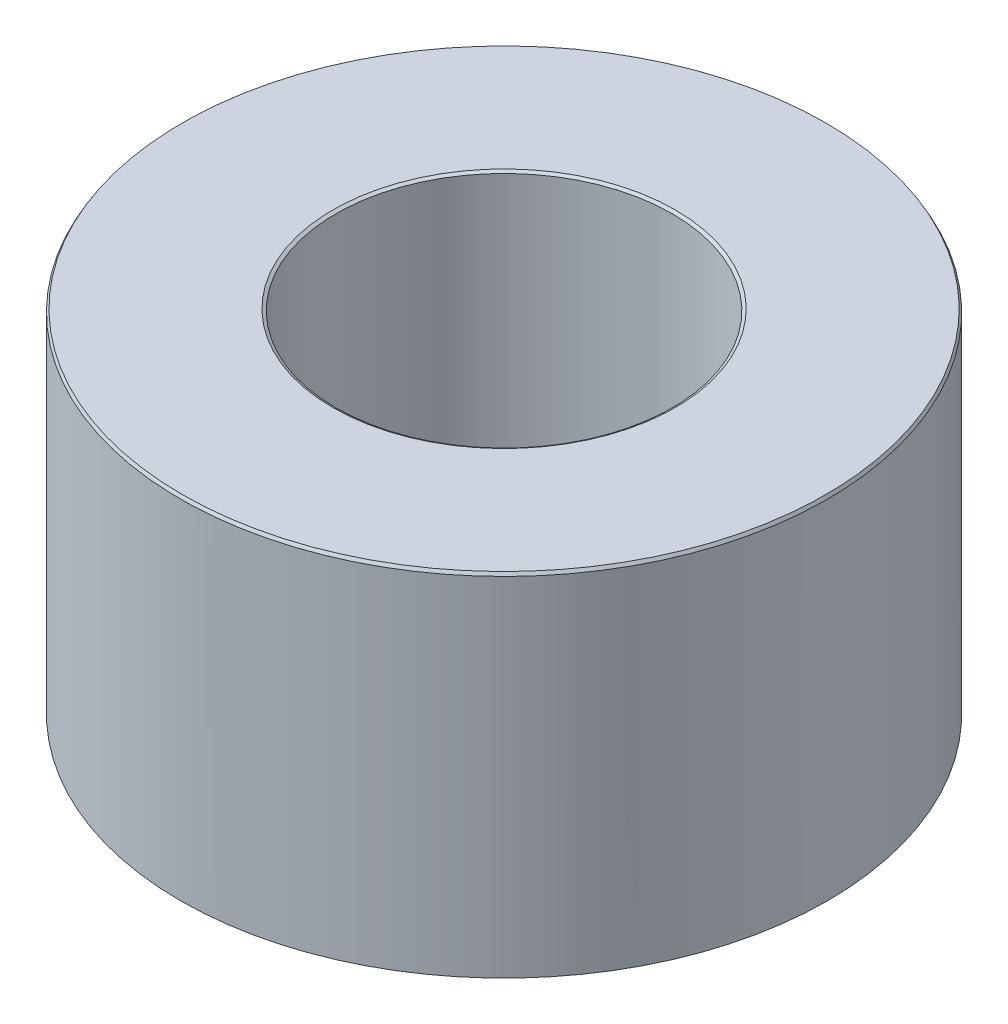
ISO-10303-21;
HEADER;
FILE_DESCRIPTION(('STEP AP214'),'2;1');
FILE_NAME('part.step','',(''),(''),'','','');
FILE_SCHEMA(('AUTOMOTIVE_DESIGN { 1 0 10303 214 1 1 1 1 }'));
ENDSEC;
DATA;
#1=APPLICATION_CONTEXT('core data for automotive mechanical design processes');
#2=APPLICATION_PROTOCOL_DEFINITION('international standard','automotive_design',2000,#1);
#3=PRODUCT_CONTEXT('',#1,'mechanical');
#4=PRODUCT('Part','Part','',(#3));
#5=PRODUCT_RELATED_PRODUCT_CATEGORY('part','',(#4));
#6=PRODUCT_DEFINITION_FORMATION('','',#4);
#7=PRODUCT_DEFINITION_CONTEXT('part definition',#1,'design');
#8=PRODUCT_DEFINITION('design','',#6,#7);
#9=PRODUCT_DEFINITION_SHAPE('','',#8);
#10=(LENGTH_UNIT() NAMED_UNIT(*) SI_UNIT(.MILLI.,.METRE.));
#11=(NAMED_UNIT(*) PLANE_ANGLE_UNIT() SI_UNIT($,.RADIAN.));
#12=(NAMED_UNIT(*) SI_UNIT($,.STERADIAN.) SOLID_ANGLE_UNIT());
#13=UNCERTAINTY_MEASURE_WITH_UNIT(LENGTH_MEASURE(1.E-05),#10,'distance_accuracy_value','');
#14=(GEOMETRIC_REPRESENTATION_CONTEXT(3) GLOBAL_UNCERTAINTY_ASSIGNED_CONTEXT((#13)) GLOBAL_UNIT_ASSIGNED_CONTEXT((#10,
#11,#12)) REPRESENTATION_CONTEXT('',''));
#15=CARTESIAN_POINT('',(0.,0.,0.));
#16=DIRECTION('',(0.,0.,1.));
#17=DIRECTION('',(1.,0.,0.));
#18=AXIS2_PLACEMENT_3D('',#15,#16,#17);
#19=CARTESIAN_POINT('',(0.,24.5218995649881,0.));
#20=DIRECTION('',(0.,-1.,0.));
#21=DIRECTION('',(0.,0.,-1.));
#22=AXIS2_PLACEMENT_3D('',#19,#20,#21);
#23=CYLINDRICAL_SURFACE('',#22,22.5);
#24=CARTESIAN_POINT('',(0.,0.122359580149285,0.));
#25=DIRECTION('',(0.,1.,0.));
#26=DIRECTION('',(0.,0.,1.));
#27=AXIS2_PLACEMENT_3D('',#24,#25,#26);
#28=CIRCLE('',#27,22.5);
#29=CARTESIAN_POINT('',(0.,0.122359580149282,-22.5));
#30=VERTEX_POINT('',#29);
#31=EDGE_CURVE('E10',#30,#30,#28,.T.);
#32=CARTESIAN_POINT('',(0.,24.3099665553768,0.));
#33=DIRECTION('',(0.,1.,0.));
#34=DIRECTION('',(0.,0.,1.));
#35=AXIS2_PLACEMENT_3D('',#32,#33,#34);
#36=CIRCLE('',#35,22.5);
#37=CARTESIAN_POINT('',(0.,24.3099665553768,-22.5));
#38=VERTEX_POINT('',#37);
#39=EDGE_CURVE('E50',#38,#38,#36,.F.);
#40=CARTESIAN_POINT('',(0.,0.122359580149282,-22.5));
#41=CARTESIAN_POINT('',(0.,0.374313819474569,-22.5));
#42=CARTESIAN_POINT('',(0.,0.626268058799857,-22.5));
#43=CARTESIAN_POINT('',(0.,1.13017653745043,-22.5));
#44=CARTESIAN_POINT('',(0.,1.38213077677572,-22.5));
#45=CARTESIAN_POINT('',(0.,1.88603925542629,-22.5));
#46=CARTESIAN_POINT('',(0.,2.13799349475158,-22.5));
#47=CARTESIAN_POINT('',(0.,2.64190197340215,-22.5));
#48=CARTESIAN_POINT('',(0.,2.89385621272744,-22.5));
#49=CARTESIAN_POINT('',(0.,3.39776469137801,-22.5));
#50=CARTESIAN_POINT('',(0.,3.6497189307033,-22.5));
#51=CARTESIAN_POINT('',(0.,4.15362740935387,-22.5));
#52=CARTESIAN_POINT('',(0.,4.40558164867916,-22.5));
#53=CARTESIAN_POINT('',(0.,4.90949012732974,-22.5));
#54=CARTESIAN_POINT('',(0.,5.16144436665502,-22.5));
#55=CARTESIAN_POINT('',(0.,5.66535284530559,-22.5));
#56=CARTESIAN_POINT('',(0.,5.91730708463088,-22.5));
#57=CARTESIAN_POINT('',(0.,6.42121556328146,-22.5));
#58=CARTESIAN_POINT('',(0.,6.67316980260674,-22.5));
#59=CARTESIAN_POINT('',(0.,7.17707828125732,-22.5));
#60=CARTESIAN_POINT('',(0.,7.4290325205826,-22.5));
#61=CARTESIAN_POINT('',(0.,7.93294099923318,-22.5));
#62=CARTESIAN_POINT('',(0.,8.18489523855847,-22.5));
#63=CARTESIAN_POINT('',(0.,8.68880371720904,-22.5));
#64=CARTESIAN_POINT('',(0.,8.94075795653433,-22.5));
#65=CARTESIAN_POINT('',(0.,9.4446664351849,-22.5));
#66=CARTESIAN_POINT('',(0.,9.69662067451018,-22.5));
#67=CARTESIAN_POINT('',(0.,10.2005291531608,-22.5));
#68=CARTESIAN_POINT('',(0.,10.452483392486,-22.5));
#69=CARTESIAN_POINT('',(0.,10.9563918711366,-22.5));
#70=CARTESIAN_POINT('',(0.,11.2083461104619,-22.5));
#71=CARTESIAN_POINT('',(0.,11.7122545891125,-22.5));
#72=CARTESIAN_POINT('',(0.,11.9642088284378,-22.5));
#73=CARTESIAN_POINT('',(0.,12.4681173070883,-22.5));
#74=CARTESIAN_POINT('',(0.,12.7200715464136,-22.5));
#75=CARTESIAN_POINT('',(0.,13.2239800250642,-22.5));
#76=CARTESIAN_POINT('',(0.,13.4759342643895,-22.5));
#77=CARTESIAN_POINT('',(0.,13.9798427430401,-22.5));
#78=CARTESIAN_POINT('',(0.,14.2317969823654,-22.5));
#79=CARTESIAN_POINT('',(0.,14.7357054610159,-22.5));
#80=CARTESIAN_POINT('',(0.,14.9876597003412,-22.5));
#81=CARTESIAN_POINT('',(0.,15.4915681789918,-22.5));
#82=CARTESIAN_POINT('',(0.,15.7435224183171,-22.5));
#83=CARTESIAN_POINT('',(0.,16.2474308969676,-22.5));
#84=CARTESIAN_POINT('',(0.,16.4993851362929,-22.5));
#85=CARTESIAN_POINT('',(0.,17.0032936149435,-22.5));
#86=CARTESIAN_POINT('',(0.,17.2552478542688,-22.5));
#87=CARTESIAN_POINT('',(0.,17.7591563329194,-22.5));
#88=CARTESIAN_POINT('',(0.,18.0111105722447,-22.5));
#89=CARTESIAN_POINT('',(0.,18.5150190508952,-22.5));
#90=CARTESIAN_POINT('',(0.,18.7669732902205,-22.5));
#91=CARTESIAN_POINT('',(0.,19.2708817688711,-22.5));
#92=CARTESIAN_POINT('',(0.,19.5228360081964,-22.5));
#93=CARTESIAN_POINT('',(0.,20.0267444868469,-22.5));
#94=CARTESIAN_POINT('',(0.,20.2786987261722,-22.5));
#95=CARTESIAN_POINT('',(0.,20.7826072048228,-22.5));
#96=CARTESIAN_POINT('',(0.,21.0345614441481,-22.5));
#97=CARTESIAN_POINT('',(0.,21.5384699227987,-22.5));
#98=CARTESIAN_POINT('',(0.,21.790424162124,-22.5));
#99=CARTESIAN_POINT('',(0.,22.2943326407745,-22.5));
#100=CARTESIAN_POINT('',(0.,22.5462868800998,-22.5));
#101=CARTESIAN_POINT('',(0.,23.0501953587504,-22.5));
#102=CARTESIAN_POINT('',(0.,23.3021495980757,-22.5));
#103=CARTESIAN_POINT('',(0.,23.8060580767263,-22.5));
#104=CARTESIAN_POINT('',(0.,24.0580123160515,-22.5));
#105=CARTESIAN_POINT('',(0.,24.3099665553768,-22.5));
#106=B_SPLINE_CURVE_WITH_KNOTS('',3,(#40,#41,#42,#43,#44,#45,#46,#47,#48,#49,#50,#51,#52,#53,
#54,#55,#56,#57,#58,#59,#60,#61,#62,#63,#64,#65,#66,#67,#68,#69,#70,#71,#72,#73,#74,#75,#76,#77,
#78,#79,#80,#81,#82,#83,#84,#85,#86,#87,#88,#89,#90,#91,#92,#93,#94,#95,#96,#97,#98,#99,#100,
#101,#102,#103,#104,#105),.UNSPECIFIED.,.F.,.F.,(4,2,2,2,2,2,2,2,2,2,2,2,2,2,2,2,2,2,2,2,2,2,2,
2,2,2,2,2,2,2,2,2,4),(0.,0.755862717975862,1.51172543595172,2.26758815392758,3.02345087190344,
3.7793135898793,4.53517630785517,5.29103902583103,6.04690174380689,6.80276446178275,
7.55862717975861,8.31448989773447,9.07035261571033,9.82621533368619,10.5820780516621,
11.3379407696379,12.0938034876138,12.8496662055896,13.6055289235655,14.3613916415414,
15.1172543595172,15.8731170774931,16.6289797954689,17.3848425134448,18.1407052314207,
18.8965679493965,19.6524306673724,20.4082933853482,21.1641561033241,21.9200188213,
22.6758815392758,23.4317442572517,24.1876069752275),.UNSPECIFIED.);
#107=EDGE_CURVE('BSEAM39',#30,#38,#106,.T.);
#108=ORIENTED_EDGE('',*,*,#31,.T.);
#109=ORIENTED_EDGE('',*,*,#39,.T.);
#110=ORIENTED_EDGE('',*,*,#107,.T.);
#111=ORIENTED_EDGE('',*,*,#107,.F.);
#112=EDGE_LOOP('',(#108,#110,#109,#111));
#113=FACE_BOUND('',#112,.T.);
#114=ADVANCED_FACE('F39',(#113),#23,.T.);
#115=CARTESIAN_POINT('',(0.,24.5218995649881,0.));
#116=DIRECTION('',(0.,1.,0.));
#117=DIRECTION('',(0.,0.,1.));
#118=AXIS2_PLACEMENT_3D('',#115,#116,#117);
#119=PLANE('',#118);
#120=CARTESIAN_POINT('',(0.,24.5218995649881,0.));
#121=DIRECTION('',(0.,1.,0.));
#122=DIRECTION('',(0.,0.,1.));
#123=AXIS2_PLACEMENT_3D('',#120,#121,#122);
#124=CIRCLE('',#123,11.9055841258834);
#125=CARTESIAN_POINT('',(0.,24.5218995649881,11.9055841258834));
#126=VERTEX_POINT('',#125);
#127=EDGE_CURVE('E58',#126,#126,#124,.F.);
#128=ORIENTED_EDGE('',*,*,#127,.T.);
#129=EDGE_LOOP('',(#128));
#130=FACE_BOUND('',#129,.T.);
#131=CARTESIAN_POINT('',(0.,24.5218995649881,0.));
#132=DIRECTION('',(0.,1.,0.));
#133=DIRECTION('',(0.,0.,1.));
#134=AXIS2_PLACEMENT_3D('',#131,#132,#133);
#135=CIRCLE('',#134,22.3776404198508);
#136=CARTESIAN_POINT('',(0.,24.5218995649881,22.3776404198508));
#137=VERTEX_POINT('',#136);
#138=EDGE_CURVE('E61',#137,#137,#135,.T.);
#139=ORIENTED_EDGE('',*,*,#138,.T.);
#140=EDGE_LOOP('',(#139));
#141=FACE_BOUND('',#140,.T.);
#142=ADVANCED_FACE('F88',(#130,#141),#119,.T.);
#143=CARTESIAN_POINT('',(0.,0.,0.));
#144=DIRECTION('',(0.,1.,0.));
#145=DIRECTION('',(0.,0.,1.));
#146=AXIS2_PLACEMENT_3D('',#143,#144,#145);
#147=PLANE('',#146);
#148=CARTESIAN_POINT('',(0.,0.,0.));
#149=DIRECTION('',(0.,1.,0.));
#150=DIRECTION('',(0.,0.,1.));
#151=AXIS2_PLACEMENT_3D('',#148,#149,#150);
#152=CIRCLE('',#151,11.8160106964213);
#153=CARTESIAN_POINT('',(0.,0.,-11.8160106964213));
#154=VERTEX_POINT('',#153);
#155=EDGE_CURVE('E51',#154,#154,#152,.T.);
#156=ORIENTED_EDGE('',*,*,#155,.T.);
#157=EDGE_LOOP('',(#156));
#158=FACE_BOUND('',#157,.T.);
#159=CARTESIAN_POINT('',(0.,0.,0.));
#160=DIRECTION('',(0.,1.,0.));
#161=DIRECTION('',(0.,0.,1.));
#162=AXIS2_PLACEMENT_3D('',#159,#160,#161);
#163=CIRCLE('',#162,22.2880669903886);
#164=CARTESIAN_POINT('',(0.,0.,22.2880669903886));
#165=VERTEX_POINT('',#164);
#166=EDGE_CURVE('E54',#165,#165,#163,.F.);
#167=ORIENTED_EDGE('',*,*,#166,.T.);
#168=EDGE_LOOP('',(#167));
#169=FACE_BOUND('',#168,.T.);
#170=ADVANCED_FACE('F83',(#158,#169),#147,.F.);
#171=CARTESIAN_POINT('',(0.,24.5218995649881,0.));
#172=DIRECTION('',(0.,-1.,0.));
#173=DIRECTION('',(0.,0.,-1.));
#174=AXIS2_PLACEMENT_3D('',#171,#172,#173);
#175=CYLINDRICAL_SURFACE('',#174,11.693651116272);
#176=CARTESIAN_POINT('',(0.,24.3995399848388,0.));
#177=DIRECTION('',(0.,1.,0.));
#178=DIRECTION('',(0.,0.,1.));
#179=AXIS2_PLACEMENT_3D('',#176,#177,#178);
#180=CIRCLE('',#179,11.693651116272);
#181=CARTESIAN_POINT('',(0.,24.3995399848388,-11.693651116272));
#182=VERTEX_POINT('',#181);
#183=EDGE_CURVE('E67',#182,#182,#180,.T.);
#184=CARTESIAN_POINT('',(0.,0.211933009611285,0.));
#185=DIRECTION('',(0.,1.,0.));
#186=DIRECTION('',(0.,0.,1.));
#187=AXIS2_PLACEMENT_3D('',#184,#185,#186);
#188=CIRCLE('',#187,11.693651116272);
#189=CARTESIAN_POINT('',(0.,0.211933009611285,-11.693651116272));
#190=VERTEX_POINT('',#189);
#191=EDGE_CURVE('E69',#190,#190,#188,.F.);
#192=CARTESIAN_POINT('',(0.,24.3995399848388,-11.693651116272));
#193=CARTESIAN_POINT('',(0.,24.1475857455136,-11.693651116272));
#194=CARTESIAN_POINT('',(0.,23.8956315061883,-11.693651116272));
#195=CARTESIAN_POINT('',(0.,23.3917230275377,-11.693651116272));
#196=CARTESIAN_POINT('',(0.,23.1397687882124,-11.693651116272));
#197=CARTESIAN_POINT('',(0.,22.6358603095618,-11.693651116272));
#198=CARTESIAN_POINT('',(0.,22.3839060702365,-11.693651116272));
#199=CARTESIAN_POINT('',(0.,21.879997591586,-11.693651116272));
#200=CARTESIAN_POINT('',(0.,21.6280433522607,-11.693651116272));
#201=CARTESIAN_POINT('',(0.,21.1241348736101,-11.693651116272));
#202=CARTESIAN_POINT('',(0.,20.8721806342848,-11.693651116272));
#203=CARTESIAN_POINT('',(0.,20.3682721556342,-11.693651116272));
#204=CARTESIAN_POINT('',(0.,20.116317916309,-11.693651116272));
#205=CARTESIAN_POINT('',(0.,19.6124094376584,-11.693651116272));
#206=CARTESIAN_POINT('',(0.,19.3604551983331,-11.693651116272));
#207=CARTESIAN_POINT('',(0.,18.8565467196825,-11.693651116272));
#208=CARTESIAN_POINT('',(0.,18.6045924803572,-11.693651116272));
#209=CARTESIAN_POINT('',(0.,18.1006840017067,-11.693651116272));
#210=CARTESIAN_POINT('',(0.,17.8487297623814,-11.693651116272));
#211=CARTESIAN_POINT('',(0.,17.3448212837308,-11.693651116272));
#212=CARTESIAN_POINT('',(0.,17.0928670444055,-11.693651116272));
#213=CARTESIAN_POINT('',(0.,16.5889585657549,-11.693651116272));
#214=CARTESIAN_POINT('',(0.,16.3370043264297,-11.693651116272));
#215=CARTESIAN_POINT('',(0.,15.8330958477791,-11.693651116272));
#216=CARTESIAN_POINT('',(0.,15.5811416084538,-11.693651116272));
#217=CARTESIAN_POINT('',(0.,15.0772331298032,-11.693651116272));
#218=CARTESIAN_POINT('',(0.,14.8252788904779,-11.693651116272));
#219=CARTESIAN_POINT('',(0.,14.3213704118274,-11.693651116272));
#220=CARTESIAN_POINT('',(0.,14.0694161725021,-11.693651116272));
#221=CARTESIAN_POINT('',(0.,13.5655076938515,-11.693651116272));
#222=CARTESIAN_POINT('',(0.,13.3135534545262,-11.693651116272));
#223=CARTESIAN_POINT('',(0.,12.8096449758756,-11.693651116272));
#224=CARTESIAN_POINT('',(0.,12.5576907365504,-11.693651116272));
#225=CARTESIAN_POINT('',(0.,12.0537822578998,-11.693651116272));
#226=CARTESIAN_POINT('',(0.,11.8018280185745,-11.693651116272));
#227=CARTESIAN_POINT('',(0.,11.2979195399239,-11.693651116272));
#228=CARTESIAN_POINT('',(0.,11.0459653005986,-11.693651116272));
#229=CARTESIAN_POINT('',(0.,10.5420568219481,-11.693651116272));
#230=CARTESIAN_POINT('',(0.,10.2901025826228,-11.693651116272));
#231=CARTESIAN_POINT('',(0.,9.78619410397219,-11.693651116272));
#232=CARTESIAN_POINT('',(0.,9.53423986464691,-11.693651116272));
#233=CARTESIAN_POINT('',(0.,9.03033138599633,-11.693651116272));
#234=CARTESIAN_POINT('',(0.,8.77837714667105,-11.693651116272));
#235=CARTESIAN_POINT('',(0.,8.27446866802048,-11.693651116272));
#236=CARTESIAN_POINT('',(0.,8.02251442869519,-11.693651116272));
#237=CARTESIAN_POINT('',(0.,7.51860595004461,-11.693651116272));
#238=CARTESIAN_POINT('',(0.,7.26665171071933,-11.693651116272));
#239=CARTESIAN_POINT('',(0.,6.76274323206875,-11.693651116272));
#240=CARTESIAN_POINT('',(0.,6.51078899274346,-11.693651116272));
#241=CARTESIAN_POINT('',(0.,6.00688051409289,-11.693651116272));
#242=CARTESIAN_POINT('',(0.,5.7549262747676,-11.693651116272));
#243=CARTESIAN_POINT('',(0.,5.25101779611703,-11.693651116272));
#244=CARTESIAN_POINT('',(0.,4.99906355679174,-11.693651116272));
#245=CARTESIAN_POINT('',(0.,4.49515507814116,-11.693651116272));
#246=CARTESIAN_POINT('',(0.,4.24320083881588,-11.693651116272));
#247=CARTESIAN_POINT('',(0.,3.7392923601653,-11.693651116272));
#248=CARTESIAN_POINT('',(0.,3.48733812084002,-11.693651116272));
#249=CARTESIAN_POINT('',(0.,2.98342964218945,-11.693651116272));
#250=CARTESIAN_POINT('',(0.,2.73147540286416,-11.693651116272));
#251=CARTESIAN_POINT('',(0.,2.22756692421358,-11.693651116272));
#252=CARTESIAN_POINT('',(0.,1.9756126848883,-11.693651116272));
#253=CARTESIAN_POINT('',(0.,1.47170420623772,-11.693651116272));
#254=CARTESIAN_POINT('',(0.,1.21974996691243,-11.693651116272));
#255=CARTESIAN_POINT('',(0.,0.71584148826186,-11.693651116272));
#256=CARTESIAN_POINT('',(0.,0.463887248936572,-11.693651116272));
#257=CARTESIAN_POINT('',(0.,0.211933009611285,-11.693651116272));
#258=B_SPLINE_CURVE_WITH_KNOTS('',3,(#192,#193,#194,#195,#196,#197,#198,#199,#200,#201,#202,
#203,#204,#205,#206,#207,#208,#209,#210,#211,#212,#213,#214,#215,#216,#217,#218,#219,#220,#221,
#222,#223,#224,#225,#226,#227,#228,#229,#230,#231,#232,#233,#234,#235,#236,#237,#238,#239,#240,
#241,#242,#243,#244,#245,#246,#247,#248,#249,#250,#251,#252,#253,#254,#255,#256,#257),
.UNSPECIFIED.,.F.,.F.,(4,2,2,2,2,2,2,2,2,2,2,2,2,2,2,2,2,2,2,2,2,2,2,2,2,2,2,2,2,2,2,2,4),(0.,
0.755862717975862,1.51172543595172,2.26758815392758,3.02345087190345,3.77931358987931,
4.53517630785517,5.29103902583103,6.04690174380689,6.80276446178275,7.55862717975861,
8.31448989773448,9.07035261571033,9.8262153336862,10.5820780516621,11.3379407696379,
12.0938034876138,12.8496662055896,13.6055289235655,14.3613916415414,15.1172543595172,
15.8731170774931,16.6289797954689,17.3848425134448,18.1407052314207,18.8965679493965,
19.6524306673724,20.4082933853483,21.1641561033241,21.9200188213,22.6758815392758,
23.4317442572517,24.1876069752276),.UNSPECIFIED.);
#259=EDGE_CURVE('BSEAM71',#182,#190,#258,.T.);
#260=ORIENTED_EDGE('',*,*,#183,.T.);
#261=ORIENTED_EDGE('',*,*,#191,.T.);
#262=ORIENTED_EDGE('',*,*,#259,.T.);
#263=ORIENTED_EDGE('',*,*,#259,.F.);
#264=EDGE_LOOP('',(#260,#262,#261,#263));
#265=FACE_BOUND('',#264,.T.);
#266=ADVANCED_FACE('F71',(#265),#175,.F.);
#267=CARTESIAN_POINT('',(0.,24.3995399848388,0.));
#268=DIRECTION('',(0.,1.,0.));
#269=DIRECTION('',(0.,0.,1.));
#270=AXIS2_PLACEMENT_3D('',#267,#268,#269);
#271=CONICAL_SURFACE('',#270,11.693651116272,1.04719755119661);
#272=ORIENTED_EDGE('',*,*,#127,.F.);
#273=EDGE_LOOP('',(#272));
#274=FACE_BOUND('',#273,.T.);
#275=ORIENTED_EDGE('',*,*,#183,.F.);
#276=EDGE_LOOP('',(#275));
#277=FACE_BOUND('',#276,.T.);
#278=ADVANCED_FACE('F77',(#274,#277),#271,.F.);
#279=CARTESIAN_POINT('',(0.,0.,0.));
#280=DIRECTION('',(0.,-1.,0.));
#281=DIRECTION('',(0.,0.,-1.));
#282=AXIS2_PLACEMENT_3D('',#279,#280,#281);
#283=CONICAL_SURFACE('',#282,11.8160106964213,0.523598775598301);
#284=CARTESIAN_POINT('',(0.,0.211933009611285,-11.693651116272));
#285=CARTESIAN_POINT('',(0.,0.2097253740945,-11.6949256952319));
#286=CARTESIAN_POINT('',(0.,0.207517738577716,-11.6962002741918));
#287=CARTESIAN_POINT('',(0.,0.203102467544148,-11.6987494321116));
#288=CARTESIAN_POINT('',(0.,0.200894832027364,-11.7000240110715));
#289=CARTESIAN_POINT('',(0.,0.196479560993796,-11.7025731689912));
#290=CARTESIAN_POINT('',(0.,0.194271925477011,-11.7038477479511));
#291=CARTESIAN_POINT('',(0.,0.189856654443443,-11.7063969058709));
#292=CARTESIAN_POINT('',(0.,0.187649018926658,-11.7076714848308));
#293=CARTESIAN_POINT('',(0.,0.18323374789309,-11.7102206427506));
#294=CARTESIAN_POINT('',(0.,0.181026112376306,-11.7114952217104));
#295=CARTESIAN_POINT('',(0.,0.176610841342738,-11.7140443796302));
#296=CARTESIAN_POINT('',(0.,0.174403205825953,-11.7153189585901));
#297=CARTESIAN_POINT('',(0.,0.169987934792385,-11.7178681165099));
#298=CARTESIAN_POINT('',(0.,0.167780299275601,-11.7191426954698));
#299=CARTESIAN_POINT('',(0.,0.163365028242032,-11.7216918533895));
#300=CARTESIAN_POINT('',(0.,0.161157392725248,-11.7229664323494));
#301=CARTESIAN_POINT('',(0.,0.156742121691679,-11.7255155902692));
#302=CARTESIAN_POINT('',(0.,0.154534486174895,-11.7267901692291));
#303=CARTESIAN_POINT('',(0.,0.150119215141327,-11.7293393271489));
#304=CARTESIAN_POINT('',(0.,0.147911579624543,-11.7306139061088));
#305=CARTESIAN_POINT('',(0.,0.143496308590974,-11.7331630640285));
#306=CARTESIAN_POINT('',(0.,0.14128867307419,-11.7344376429884));
#307=CARTESIAN_POINT('',(0.,0.136873402040621,-11.7369868009082));
#308=CARTESIAN_POINT('',(0.,0.134665766523837,-11.7382613798681));
#309=CARTESIAN_POINT('',(0.,0.130250495490269,-11.7408105377879));
#310=CARTESIAN_POINT('',(0.,0.128042859973485,-11.7420851167478));
#311=CARTESIAN_POINT('',(0.,0.123627588939916,-11.7446342746675));
#312=CARTESIAN_POINT('',(0.,0.121419953423132,-11.7459088536274));
#313=CARTESIAN_POINT('',(0.,0.117004682389563,-11.7484580115472));
#314=CARTESIAN_POINT('',(0.,0.114797046872779,-11.7497325905071));
#315=CARTESIAN_POINT('',(0.,0.110381775839211,-11.7522817484269));
#316=CARTESIAN_POINT('',(0.,0.108174140322427,-11.7535563273867));
#317=CARTESIAN_POINT('',(0.,0.103758869288858,-11.7561054853065));
#318=CARTESIAN_POINT('',(0.,0.101551233772074,-11.7573800642664));
#319=CARTESIAN_POINT('',(0.,0.0971359627385055,-11.7599292221862));
#320=CARTESIAN_POINT('',(0.,0.0949283272217215,-11.7612038011461));
#321=CARTESIAN_POINT('',(0.,0.0905130561881531,-11.7637529590659));
#322=CARTESIAN_POINT('',(0.,0.0883054206713688,-11.7650275380257));
#323=CARTESIAN_POINT('',(0.,0.0838901496378002,-11.7675766959455));
#324=CARTESIAN_POINT('',(0.,0.0816825141210159,-11.7688512749054));
#325=CARTESIAN_POINT('',(0.,0.0772672430874475,-11.7714004328252));
#326=CARTESIAN_POINT('',(0.,0.0750596075706635,-11.7726750117851));
#327=CARTESIAN_POINT('',(0.,0.0706443365370951,-11.7752241697048));
#328=CARTESIAN_POINT('',(0.,0.0684367010203106,-11.7764987486647));
#329=CARTESIAN_POINT('',(0.,0.0640214299867422,-11.7790479065845));
#330=CARTESIAN_POINT('',(0.,0.0618137944699582,-11.7803224855444));
#331=CARTESIAN_POINT('',(0.,0.0573985234363898,-11.7828716434642));
#332=CARTESIAN_POINT('',(0.,0.0551908879196055,-11.7841462224241));
#333=CARTESIAN_POINT('',(0.,0.0507756168860369,-11.7866953803438));
#334=CARTESIAN_POINT('',(0.,0.0485679813692526,-11.7879699593037));
#335=CARTESIAN_POINT('',(0.,0.0441527103356843,-11.7905191172235));
#336=CARTESIAN_POINT('',(0.,0.0419450748189003,-11.7917936961834));
#337=CARTESIAN_POINT('',(0.,0.0375298037853318,-11.7943428541032));
#338=CARTESIAN_POINT('',(0.,0.0353221682685474,-11.7956174330631));
#339=CARTESIAN_POINT('',(0.,0.0309068972349789,-11.7981665909828));
#340=CARTESIAN_POINT('',(0.,0.0286992617181949,-11.7994411699427));
#341=CARTESIAN_POINT('',(0.,0.0242839906846266,-11.8019903278625));
#342=CARTESIAN_POINT('',(0.,0.0220763551678423,-11.8032649068224));
#343=CARTESIAN_POINT('',(0.,0.0176610841342737,-11.8058140647422));
#344=CARTESIAN_POINT('',(0.,0.0154534486174894,-11.807088643702));
#345=CARTESIAN_POINT('',(0.,0.011038177583921,-11.8096378016218));
#346=CARTESIAN_POINT('',(0.,0.00883054206713688,-11.8109123805817));
#347=CARTESIAN_POINT('',(0.,0.00441527103356868,-11.8134615385015));
#348=CARTESIAN_POINT('',(0.,0.00220763551678457,-11.8147361174614));
#349=CARTESIAN_POINT('',(0.,0.,-11.8160106964213));
#350=B_SPLINE_CURVE_WITH_KNOTS('',3,(#284,#285,#286,#287,#288,#289,#290,#291,#292,#293,#294,
#295,#296,#297,#298,#299,#300,#301,#302,#303,#304,#305,#306,#307,#308,#309,#310,#311,#312,#313,
#314,#315,#316,#317,#318,#319,#320,#321,#322,#323,#324,#325,#326,#327,#328,#329,#330,#331,#332,
#333,#334,#335,#336,#337,#338,#339,#340,#341,#342,#343,#344,#345,#346,#347,#348,#349),
.UNSPECIFIED.,.F.,.F.,(4,2,2,2,2,2,2,2,2,2,2,2,2,2,2,2,2,2,2,2,2,2,2,2,2,2,2,2,2,2,2,2,4),(0.,
0.00764747375932737,0.0152949475186556,0.022942421277983,0.0305898950373103,0.0382373687966386,
0.0458848425559659,0.0535323163152942,0.0611797900746215,0.0688272638339489,0.0764747375932772,
0.0841222113526045,0.0917696851119328,0.0994171588712601,0.107064632630587,0.114712106389916,
0.122359580149243,0.13000705390857,0.137654527667899,0.145302001427226,0.152949475186553,
0.160596948945882,0.168244422705209,0.175891896464537,0.183539370223865,0.191186843983192,
0.19883431774252,0.206481791501848,0.214129265261176,0.221776739020503,0.229424212779831,
0.237071686539159,0.244719160298486),.UNSPECIFIED.);
#351=EDGE_CURVE('BSEAM73',#190,#154,#350,.T.);
#352=ORIENTED_EDGE('',*,*,#191,.F.);
#353=ORIENTED_EDGE('',*,*,#155,.F.);
#354=ORIENTED_EDGE('',*,*,#351,.T.);
#355=ORIENTED_EDGE('',*,*,#351,.F.);
#356=EDGE_LOOP('',(#352,#354,#353,#355));
#357=FACE_BOUND('',#356,.T.);
#358=ADVANCED_FACE('F73',(#357),#283,.F.);
#359=CARTESIAN_POINT('',(0.,0.122359580149285,0.));
#360=DIRECTION('',(0.,1.,0.));
#361=DIRECTION('',(0.,0.,1.));
#362=AXIS2_PLACEMENT_3D('',#359,#360,#361);
#363=CONICAL_SURFACE('',#362,22.5,1.0471975511966);
#364=ORIENTED_EDGE('',*,*,#166,.F.);
#365=EDGE_LOOP('',(#364));
#366=FACE_BOUND('',#365,.T.);
#367=ORIENTED_EDGE('',*,*,#31,.F.);
#368=EDGE_LOOP('',(#367));
#369=FACE_BOUND('',#368,.T.);
#370=ADVANCED_FACE('F76',(#366,#369),#363,.T.);
#371=CARTESIAN_POINT('',(0.,24.5218995649881,0.));
#372=DIRECTION('',(0.,-1.,0.));
#373=DIRECTION('',(0.,0.,-1.));
#374=AXIS2_PLACEMENT_3D('',#371,#372,#373);
#375=CONICAL_SURFACE('',#374,22.3776404198508,0.523598775598278);
#376=ORIENTED_EDGE('',*,*,#39,.F.);
#377=EDGE_LOOP('',(#376));
#378=FACE_BOUND('',#377,.T.);
#379=ORIENTED_EDGE('',*,*,#138,.F.);
#380=EDGE_LOOP('',(#379));
#381=FACE_BOUND('',#380,.T.);
#382=ADVANCED_FACE('F45',(#378,#381),#375,.T.);
#383=CLOSED_SHELL('',(#114,#142,#170,#266,#278,#358,#370,#382));
#384=MANIFOLD_SOLID_BREP('B2',#383);
#385=ADVANCED_BREP_SHAPE_REPRESENTATION('',(#18,#384),#14);
#386=SHAPE_DEFINITION_REPRESENTATION(#9,#385);
ENDSEC;
END-ISO-10303-21;
